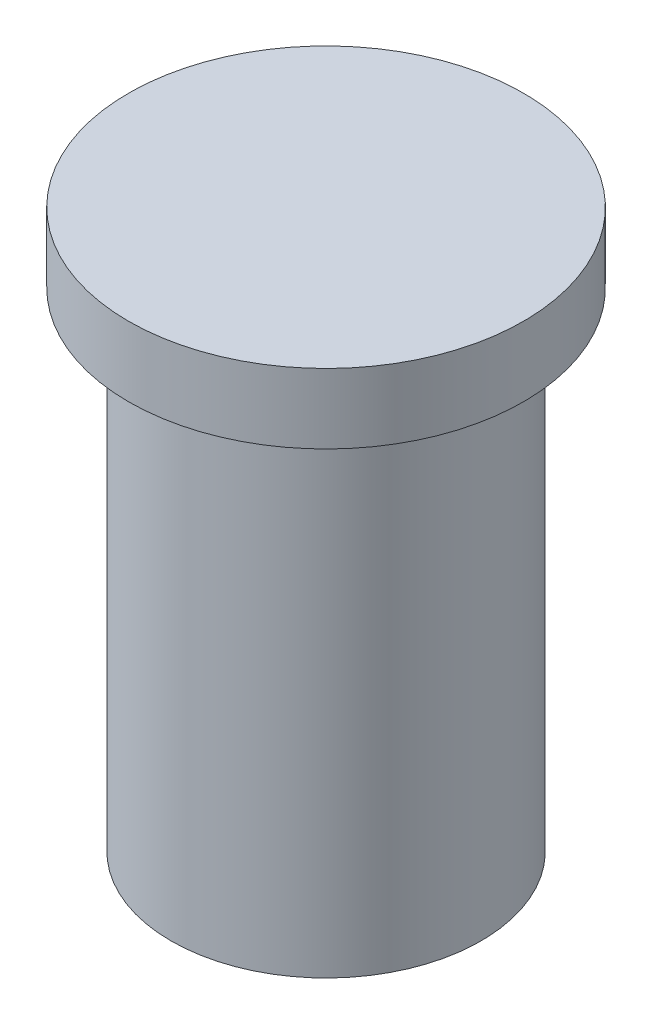
ISO-10303-21;
HEADER;
FILE_DESCRIPTION(('STEP AP214'),'2;1');
FILE_NAME('part.step','',(''),(''),'','','');
FILE_SCHEMA(('AUTOMOTIVE_DESIGN { 1 0 10303 214 1 1 1 1 }'));
ENDSEC;
DATA;
#1=APPLICATION_CONTEXT('core data for automotive mechanical design processes');
#2=APPLICATION_PROTOCOL_DEFINITION('international standard','automotive_design',2000,#1);
#3=PRODUCT_CONTEXT('',#1,'mechanical');
#4=PRODUCT('Part','Part','',(#3));
#5=PRODUCT_RELATED_PRODUCT_CATEGORY('part','',(#4));
#6=PRODUCT_DEFINITION_FORMATION('','',#4);
#7=PRODUCT_DEFINITION_CONTEXT('part definition',#1,'design');
#8=PRODUCT_DEFINITION('design','',#6,#7);
#9=PRODUCT_DEFINITION_SHAPE('','',#8);
#10=(LENGTH_UNIT() NAMED_UNIT(*) SI_UNIT(.MILLI.,.METRE.));
#11=(NAMED_UNIT(*) PLANE_ANGLE_UNIT() SI_UNIT($,.RADIAN.));
#12=(NAMED_UNIT(*) SI_UNIT($,.STERADIAN.) SOLID_ANGLE_UNIT());
#13=UNCERTAINTY_MEASURE_WITH_UNIT(LENGTH_MEASURE(1.E-05),#10,'distance_accuracy_value','');
#14=(GEOMETRIC_REPRESENTATION_CONTEXT(3) GLOBAL_UNCERTAINTY_ASSIGNED_CONTEXT((#13)) GLOBAL_UNIT_ASSIGNED_CONTEXT((#10,
#11,#12)) REPRESENTATION_CONTEXT('',''));
#15=CARTESIAN_POINT('',(0.,0.,0.));
#16=DIRECTION('',(0.,0.,1.));
#17=DIRECTION('',(1.,0.,0.));
#18=AXIS2_PLACEMENT_3D('',#15,#16,#17);
#19=CARTESIAN_POINT('',(0.,10.,0.));
#20=DIRECTION('',(0.,1.,0.));
#21=DIRECTION('',(0.,0.,1.));
#22=AXIS2_PLACEMENT_3D('',#19,#20,#21);
#23=PLANE('',#22);
#24=CARTESIAN_POINT('',(0.,10.,0.));
#25=DIRECTION('',(0.,1.,0.));
#26=DIRECTION('',(0.,0.,1.));
#27=AXIS2_PLACEMENT_3D('',#24,#25,#26);
#28=CIRCLE('',#27,28.321);
#29=CARTESIAN_POINT('',(0.,10.,28.321));
#30=VERTEX_POINT('',#29);
#31=EDGE_CURVE('E10',#30,#30,#28,.T.);
#32=ORIENTED_EDGE('',*,*,#31,.T.);
#33=EDGE_LOOP('',(#32));
#34=FACE_BOUND('',#33,.T.);
#35=ADVANCED_FACE('F31',(#34),#23,.T.);
#36=CARTESIAN_POINT('',(0.,0.,0.));
#37=DIRECTION('',(0.,1.,0.));
#38=DIRECTION('',(0.,0.,1.));
#39=AXIS2_PLACEMENT_3D('',#36,#37,#38);
#40=PLANE('',#39);
#41=CARTESIAN_POINT('',(0.,0.,0.));
#42=DIRECTION('',(0.,1.,0.));
#43=DIRECTION('',(0.,0.,1.));
#44=AXIS2_PLACEMENT_3D('',#41,#42,#43);
#45=CIRCLE('',#44,22.225);
#46=CARTESIAN_POINT('',(0.,0.,22.225));
#47=VERTEX_POINT('',#46);
#48=EDGE_CURVE('E44',#47,#47,#45,.T.);
#49=ORIENTED_EDGE('',*,*,#48,.T.);
#50=EDGE_LOOP('',(#49));
#51=FACE_BOUND('',#50,.T.);
#52=CARTESIAN_POINT('',(0.,0.,0.));
#53=DIRECTION('',(0.,1.,0.));
#54=DIRECTION('',(0.,0.,1.));
#55=AXIS2_PLACEMENT_3D('',#52,#53,#54);
#56=CIRCLE('',#55,28.321);
#57=CARTESIAN_POINT('',(0.,0.,28.321));
#58=VERTEX_POINT('',#57);
#59=EDGE_CURVE('E35',#58,#58,#56,.T.);
#60=ORIENTED_EDGE('',*,*,#59,.F.);
#61=EDGE_LOOP('',(#60));
#62=FACE_BOUND('',#61,.T.);
#63=ADVANCED_FACE('F61',(#51,#62),#40,.F.);
#64=CARTESIAN_POINT('',(0.,10.,0.));
#65=DIRECTION('',(0.,-1.,0.));
#66=DIRECTION('',(0.,0.,-1.));
#67=AXIS2_PLACEMENT_3D('',#64,#65,#66);
#68=CYLINDRICAL_SURFACE('',#67,28.321);
#69=ORIENTED_EDGE('',*,*,#31,.F.);
#70=EDGE_LOOP('',(#69));
#71=FACE_BOUND('',#70,.T.);
#72=ORIENTED_EDGE('',*,*,#59,.T.);
#73=EDGE_LOOP('',(#72));
#74=FACE_BOUND('',#73,.T.);
#75=ADVANCED_FACE('F33',(#71,#74),#68,.T.);
#76=CARTESIAN_POINT('',(0.,-70.,0.));
#77=DIRECTION('',(0.,1.,0.));
#78=DIRECTION('',(0.,0.,1.));
#79=AXIS2_PLACEMENT_3D('',#76,#77,#78);
#80=CYLINDRICAL_SURFACE('',#79,22.225);
#81=CARTESIAN_POINT('',(0.,-70.,0.));
#82=DIRECTION('',(0.,1.,0.));
#83=DIRECTION('',(0.,0.,1.));
#84=AXIS2_PLACEMENT_3D('',#81,#82,#83);
#85=CIRCLE('',#84,22.225);
#86=CARTESIAN_POINT('',(0.,-70.,22.225));
#87=VERTEX_POINT('',#86);
#88=EDGE_CURVE('E42',#87,#87,#85,.T.);
#89=ORIENTED_EDGE('',*,*,#88,.T.);
#90=EDGE_LOOP('',(#89));
#91=FACE_BOUND('',#90,.T.);
#92=ORIENTED_EDGE('',*,*,#48,.F.);
#93=EDGE_LOOP('',(#92));
#94=FACE_BOUND('',#93,.T.);
#95=ADVANCED_FACE('F50',(#91,#94),#80,.T.);
#96=CARTESIAN_POINT('',(0.,-70.,0.));
#97=DIRECTION('',(0.,1.,0.));
#98=DIRECTION('',(0.,0.,1.));
#99=AXIS2_PLACEMENT_3D('',#96,#97,#98);
#100=PLANE('',#99);
#101=ORIENTED_EDGE('',*,*,#88,.F.);
#102=EDGE_LOOP('',(#101));
#103=FACE_BOUND('',#102,.T.);
#104=ADVANCED_FACE('F53',(#103),#100,.F.);
#105=CLOSED_SHELL('',(#35,#63,#75,#95,#104));
#106=MANIFOLD_SOLID_BREP('B2',#105);
#107=ADVANCED_BREP_SHAPE_REPRESENTATION('',(#18,#106),#14);
#108=SHAPE_DEFINITION_REPRESENTATION(#9,#107);
ENDSEC;
END-ISO-10303-21;
